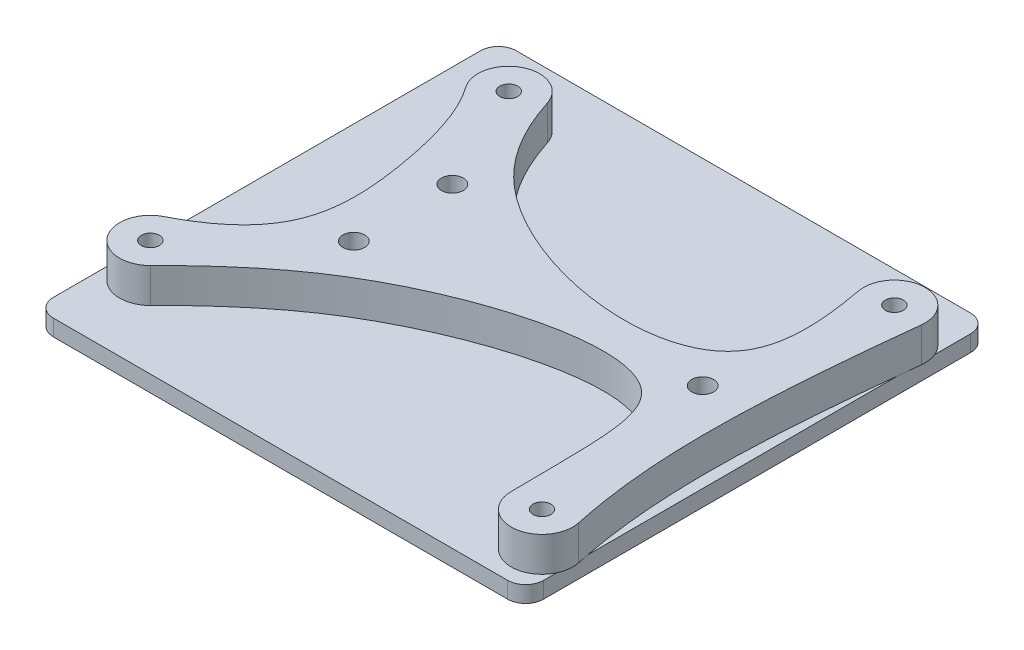
ISO-10303-21;
HEADER;
FILE_DESCRIPTION(('STEP AP214'),'2;1');
FILE_NAME('part.step','',(''),(''),'','','');
FILE_SCHEMA(('AUTOMOTIVE_DESIGN { 1 0 10303 214 1 1 1 1 }'));
ENDSEC;
DATA;
#1=APPLICATION_CONTEXT('core data for automotive mechanical design processes');
#2=APPLICATION_PROTOCOL_DEFINITION('international standard','automotive_design',2000,#1);
#3=PRODUCT_CONTEXT('',#1,'mechanical');
#4=PRODUCT('Part','Part','',(#3));
#5=PRODUCT_RELATED_PRODUCT_CATEGORY('part','',(#4));
#6=PRODUCT_DEFINITION_FORMATION('','',#4);
#7=PRODUCT_DEFINITION_CONTEXT('part definition',#1,'design');
#8=PRODUCT_DEFINITION('design','',#6,#7);
#9=PRODUCT_DEFINITION_SHAPE('','',#8);
#10=(LENGTH_UNIT() NAMED_UNIT(*) SI_UNIT(.MILLI.,.METRE.));
#11=(NAMED_UNIT(*) PLANE_ANGLE_UNIT() SI_UNIT($,.RADIAN.));
#12=(NAMED_UNIT(*) SI_UNIT($,.STERADIAN.) SOLID_ANGLE_UNIT());
#13=UNCERTAINTY_MEASURE_WITH_UNIT(LENGTH_MEASURE(1.E-05),#10,'distance_accuracy_value','');
#14=(GEOMETRIC_REPRESENTATION_CONTEXT(3) GLOBAL_UNCERTAINTY_ASSIGNED_CONTEXT((#13)) GLOBAL_UNIT_ASSIGNED_CONTEXT((#10,
#11,#12)) REPRESENTATION_CONTEXT('',''));
#15=CARTESIAN_POINT('',(0.,0.,0.));
#16=DIRECTION('',(0.,0.,1.));
#17=DIRECTION('',(1.,0.,0.));
#18=AXIS2_PLACEMENT_3D('',#15,#16,#17);
#19=CARTESIAN_POINT('',(61.3562786520063,9.35,-16.8953725225901));
#20=CARTESIAN_POINT('',(60.2027794429432,9.35,-6.60297791190577));
#21=CARTESIAN_POINT('',(58.2428992183162,9.35,14.0929435496525));
#22=CARTESIAN_POINT('',(58.9374862063049,9.35,34.7888430158028));
#23=CARTESIAN_POINT('',(61.3653600024996,9.35,46.0884653405845));
#24=B_SPLINE_CURVE_WITH_KNOTS('',3,(#19,#20,#21,#22,#23),.UNSPECIFIED.,.F.,.F.,(4,1,4),(0.,
0.477057230479133,1.),.UNSPECIFIED.);
#25=DIRECTION('',(0.,-1.,0.));
#26=VECTOR('',#25,1.);
#27=SURFACE_OF_LINEAR_EXTRUSION('',#24,#26);
#28=CARTESIAN_POINT('',(61.3562786520063,3.,-16.8953725225901));
#29=CARTESIAN_POINT('',(60.2027794429432,3.,-6.60297791190577));
#30=CARTESIAN_POINT('',(58.2428992183162,3.,14.0929435496525));
#31=CARTESIAN_POINT('',(58.9374862063049,3.,34.7888430158028));
#32=CARTESIAN_POINT('',(61.3653600024996,3.,46.0884653405845));
#33=B_SPLINE_CURVE_WITH_KNOTS('',3,(#28,#29,#30,#31,#32),.UNSPECIFIED.,.F.,.F.,(4,1,4),(0.,
0.477057230479133,1.),.UNSPECIFIED.);
#34=CARTESIAN_POINT('',(61.3562786520063,3.,-16.8953725225901));
#35=VERTEX_POINT('',#34);
#36=CARTESIAN_POINT('',(61.3653600024996,3.,46.0884653405845));
#37=VERTEX_POINT('',#36);
#38=EDGE_CURVE('E201',#35,#37,#33,.T.);
#39=ORIENTED_EDGE('',*,*,#38,.F.);
#40=DIRECTION('',(0.,-1.,0.));
#41=VECTOR('',#40,1.);
#42=CARTESIAN_POINT('',(61.3562786520063,9.35,-16.8953725225901));
#43=LINE('',#42,#41);
#44=CARTESIAN_POINT('',(61.3562786520063,9.35,-16.8953725225901));
#45=VERTEX_POINT('',#44);
#46=EDGE_CURVE('E12',#45,#35,#43,.T.);
#47=ORIENTED_EDGE('',*,*,#46,.F.);
#48=CARTESIAN_POINT('',(61.3653600024996,9.35,46.0884653405845));
#49=VERTEX_POINT('',#48);
#50=EDGE_CURVE('E255',#45,#49,#24,.T.);
#51=ORIENTED_EDGE('',*,*,#50,.T.);
#52=DIRECTION('',(0.,-1.,0.));
#53=VECTOR('',#52,1.);
#54=CARTESIAN_POINT('',(61.3653600024996,9.35,46.0884653405845));
#55=LINE('',#54,#53);
#56=EDGE_CURVE('E100',#49,#37,#55,.T.);
#57=ORIENTED_EDGE('',*,*,#56,.T.);
#58=EDGE_LOOP('',(#39,#47,#51,#57));
#59=FACE_BOUND('',#58,.T.);
#60=ADVANCED_FACE('F48',(#59),#27,.T.);
#61=CARTESIAN_POINT('',(55.7414308426073,9.35,-17.5246451799393));
#62=DIRECTION('',(0.,-1.,0.));
#63=DIRECTION('',(0.,0.,-1.));
#64=AXIS2_PLACEMENT_3D('',#61,#62,#63);
#65=CYLINDRICAL_SURFACE('',#64,5.65);
#66=CARTESIAN_POINT('',(55.7414308426073,3.,-17.5246451799393));
#67=DIRECTION('',(0.,1.,0.));
#68=DIRECTION('',(0.,0.,1.));
#69=AXIS2_PLACEMENT_3D('',#66,#67,#68);
#70=CIRCLE('',#69,5.65);
#71=CARTESIAN_POINT('',(50.1907107750681,3.,-16.470127881922));
#72=VERTEX_POINT('',#71);
#73=EDGE_CURVE('E196',#35,#72,#70,.T.);
#74=ORIENTED_EDGE('',*,*,#73,.T.);
#75=DIRECTION('',(0.,-1.,0.));
#76=VECTOR('',#75,1.);
#77=CARTESIAN_POINT('',(50.1907107750681,9.35,-16.470127881922));
#78=LINE('',#77,#76);
#79=CARTESIAN_POINT('',(50.1907107750681,9.35,-16.470127881922));
#80=VERTEX_POINT('',#79);
#81=EDGE_CURVE('E57',#80,#72,#78,.T.);
#82=ORIENTED_EDGE('',*,*,#81,.F.);
#83=CARTESIAN_POINT('',(55.7414308426073,9.35,-17.5246451799393));
#84=DIRECTION('',(0.,1.,0.));
#85=DIRECTION('',(0.,0.,1.));
#86=AXIS2_PLACEMENT_3D('',#83,#84,#85);
#87=CIRCLE('',#86,5.65);
#88=EDGE_CURVE('E180',#45,#80,#87,.T.);
#89=ORIENTED_EDGE('',*,*,#88,.F.);
#90=ORIENTED_EDGE('',*,*,#46,.T.);
#91=EDGE_LOOP('',(#74,#82,#89,#90));
#92=FACE_BOUND('',#91,.T.);
#93=ADVANCED_FACE('F186',(#92),#65,.T.);
#94=CARTESIAN_POINT('',(-8.28306734486056,9.35,-17.8643233868108));
#95=CARTESIAN_POINT('',(-6.34166016969181,9.35,-11.8654911040581));
#96=CARTESIAN_POINT('',(3.72454891437976,9.35,6.93469445895372));
#97=CARTESIAN_POINT('',(48.4310655080228,9.35,15.5322873185955));
#98=CARTESIAN_POINT('',(52.6448193584418,9.35,-3.55230302758804));
#99=CARTESIAN_POINT('',(50.1907107750681,9.35,-16.470127881922));
#100=B_SPLINE_CURVE_WITH_KNOTS('',3,(#94,#95,#96,#97,#98,#99),.UNSPECIFIED.,.F.,.F.,(4,1,1,4),
(0.,0.211562664026398,0.735099530781653,1.),.UNSPECIFIED.);
#101=DIRECTION('',(0.,-1.,0.));
#102=VECTOR('',#101,1.);
#103=SURFACE_OF_LINEAR_EXTRUSION('',#100,#102);
#104=CARTESIAN_POINT('',(-8.28306734486056,3.,-17.8643233868108));
#105=CARTESIAN_POINT('',(-6.34166016969181,3.,-11.8654911040581));
#106=CARTESIAN_POINT('',(3.72454891437976,3.,6.93469445895372));
#107=CARTESIAN_POINT('',(48.4310655080228,3.,15.5322873185955));
#108=CARTESIAN_POINT('',(52.6448193584418,3.,-3.55230302758804));
#109=CARTESIAN_POINT('',(50.1907107750681,3.,-16.470127881922));
#110=B_SPLINE_CURVE_WITH_KNOTS('',3,(#104,#105,#106,#107,#108,#109),.UNSPECIFIED.,.F.,.F.,(4,1,
1,4),(0.,0.211562664026398,0.735099530781653,1.),.UNSPECIFIED.);
#111=CARTESIAN_POINT('',(-8.28306734486056,3.,-17.8643233868108));
#112=VERTEX_POINT('',#111);
#113=EDGE_CURVE('E200',#112,#72,#110,.T.);
#114=ORIENTED_EDGE('',*,*,#113,.F.);
#115=DIRECTION('',(0.,-1.,0.));
#116=VECTOR('',#115,1.);
#117=CARTESIAN_POINT('',(-8.28306734486056,9.35,-17.8643233868108));
#118=LINE('',#117,#116);
#119=CARTESIAN_POINT('',(-8.28306734486056,9.35,-17.8643233868108));
#120=VERTEX_POINT('',#119);
#121=EDGE_CURVE('E263',#120,#112,#118,.T.);
#122=ORIENTED_EDGE('',*,*,#121,.F.);
#123=EDGE_CURVE('E174',#120,#80,#100,.T.);
#124=ORIENTED_EDGE('',*,*,#123,.T.);
#125=ORIENTED_EDGE('',*,*,#81,.T.);
#126=EDGE_LOOP('',(#114,#122,#124,#125));
#127=FACE_BOUND('',#126,.T.);
#128=ADVANCED_FACE('F184',(#127),#103,.T.);
#129=CARTESIAN_POINT('',(-13.6585691573927,9.35,-16.1246451799393));
#130=DIRECTION('',(0.,-1.,0.));
#131=DIRECTION('',(0.,0.,-1.));
#132=AXIS2_PLACEMENT_3D('',#129,#130,#131);
#133=CYLINDRICAL_SURFACE('',#132,5.65);
#134=CARTESIAN_POINT('',(-13.6585691573927,3.,-16.1246451799393));
#135=DIRECTION('',(0.,1.,0.));
#136=DIRECTION('',(0.,0.,1.));
#137=AXIS2_PLACEMENT_3D('',#134,#135,#136);
#138=CIRCLE('',#137,5.65);
#139=CARTESIAN_POINT('',(-18.2569112068383,3.,-12.8416967495949));
#140=VERTEX_POINT('',#139);
#141=EDGE_CURVE('E208',#112,#140,#138,.T.);
#142=ORIENTED_EDGE('',*,*,#141,.T.);
#143=DIRECTION('',(0.,-1.,0.));
#144=VECTOR('',#143,1.);
#145=CARTESIAN_POINT('',(-18.2569112068383,9.35,-12.8416967495949));
#146=LINE('',#145,#144);
#147=CARTESIAN_POINT('',(-18.2569112068383,9.35,-12.8416967495949));
#148=VERTEX_POINT('',#147);
#149=EDGE_CURVE('E260',#148,#140,#146,.T.);
#150=ORIENTED_EDGE('',*,*,#149,.F.);
#151=CARTESIAN_POINT('',(-13.6585691573927,9.35,-16.1246451799393));
#152=DIRECTION('',(0.,1.,0.));
#153=DIRECTION('',(0.,0.,1.));
#154=AXIS2_PLACEMENT_3D('',#151,#152,#153);
#155=CIRCLE('',#154,5.65);
#156=EDGE_CURVE('E169',#120,#148,#155,.T.);
#157=ORIENTED_EDGE('',*,*,#156,.F.);
#158=ORIENTED_EDGE('',*,*,#121,.T.);
#159=EDGE_LOOP('',(#142,#150,#157,#158));
#160=FACE_BOUND('',#159,.T.);
#161=ADVANCED_FACE('F162',(#160),#133,.T.);
#162=CARTESIAN_POINT('',(-18.2569112068383,9.35,-12.8416967495949));
#163=CARTESIAN_POINT('',(-14.929136489817,9.35,-8.18056766486064));
#164=CARTESIAN_POINT('',(-11.4742294970473,9.35,4.29949697767611));
#165=CARTESIAN_POINT('',(-9.93847644013207,9.35,23.7155780269013));
#166=CARTESIAN_POINT('',(-18.3040907655099,9.35,31.8350852793079));
#167=CARTESIAN_POINT('',(-25.4115159241871,9.35,35.4350212194035));
#168=B_SPLINE_CURVE_WITH_KNOTS('',3,(#162,#163,#164,#165,#166,#167),.UNSPECIFIED.,.F.,.F.,(4,1,
1,4),(0.,0.348075625897388,0.653605665315245,1.),.UNSPECIFIED.);
#169=DIRECTION('',(0.,-1.,0.));
#170=VECTOR('',#169,1.);
#171=SURFACE_OF_LINEAR_EXTRUSION('',#168,#170);
#172=CARTESIAN_POINT('',(-18.2569112068383,3.,-12.8416967495949));
#173=CARTESIAN_POINT('',(-14.929136489817,3.,-8.18056766486064));
#174=CARTESIAN_POINT('',(-11.4742294970473,3.,4.29949697767611));
#175=CARTESIAN_POINT('',(-9.93847644013207,3.,23.7155780269013));
#176=CARTESIAN_POINT('',(-18.3040907655099,3.,31.8350852793079));
#177=CARTESIAN_POINT('',(-25.4115159241871,3.,35.4350212194035));
#178=B_SPLINE_CURVE_WITH_KNOTS('',3,(#172,#173,#174,#175,#176,#177),.UNSPECIFIED.,.F.,.F.,(4,1,
1,4),(0.,0.348075625897388,0.653605665315245,1.),.UNSPECIFIED.);
#179=CARTESIAN_POINT('',(-25.4115159241871,3.,35.4350212194035));
#180=VERTEX_POINT('',#179);
#181=EDGE_CURVE('E210',#140,#180,#178,.T.);
#182=ORIENTED_EDGE('',*,*,#181,.T.);
#183=DIRECTION('',(0.,-1.,0.));
#184=VECTOR('',#183,1.);
#185=CARTESIAN_POINT('',(-25.4115159241871,9.35,35.4350212194035));
#186=LINE('',#185,#184);
#187=CARTESIAN_POINT('',(-25.4115159241871,9.35,35.4350212194035));
#188=VERTEX_POINT('',#187);
#189=EDGE_CURVE('E135',#188,#180,#186,.T.);
#190=ORIENTED_EDGE('',*,*,#189,.F.);
#191=EDGE_CURVE('E126',#148,#188,#168,.T.);
#192=ORIENTED_EDGE('',*,*,#191,.F.);
#193=ORIENTED_EDGE('',*,*,#149,.T.);
#194=EDGE_LOOP('',(#182,#190,#192,#193));
#195=FACE_BOUND('',#194,.T.);
#196=ADVANCED_FACE('F159',(#195),#171,.F.);
#197=CARTESIAN_POINT('',(-22.8585691573927,9.35,40.4753548200607));
#198=DIRECTION('',(0.,-1.,0.));
#199=DIRECTION('',(0.,0.,-1.));
#200=AXIS2_PLACEMENT_3D('',#197,#198,#199);
#201=CYLINDRICAL_SURFACE('',#200,5.65);
#202=CARTESIAN_POINT('',(-22.8585691573927,3.,40.4753548200607));
#203=DIRECTION('',(0.,1.,0.));
#204=DIRECTION('',(0.,0.,1.));
#205=AXIS2_PLACEMENT_3D('',#202,#203,#204);
#206=CIRCLE('',#205,5.65);
#207=CARTESIAN_POINT('',(-18.8531785347097,3.,44.4602445248987));
#208=VERTEX_POINT('',#207);
#209=EDGE_CURVE('E134',#180,#208,#206,.T.);
#210=ORIENTED_EDGE('',*,*,#209,.T.);
#211=DIRECTION('',(0.,-1.,0.));
#212=VECTOR('',#211,1.);
#213=CARTESIAN_POINT('',(-18.8531785347097,9.35,44.4602445248987));
#214=LINE('',#213,#212);
#215=CARTESIAN_POINT('',(-18.8531785347097,9.35,44.4602445248987));
#216=VERTEX_POINT('',#215);
#217=EDGE_CURVE('E131',#216,#208,#214,.T.);
#218=ORIENTED_EDGE('',*,*,#217,.F.);
#219=CARTESIAN_POINT('',(-22.8585691573927,9.35,40.4753548200607));
#220=DIRECTION('',(0.,1.,0.));
#221=DIRECTION('',(0.,0.,1.));
#222=AXIS2_PLACEMENT_3D('',#219,#220,#221);
#223=CIRCLE('',#222,5.65);
#224=EDGE_CURVE('E119',#188,#216,#223,.T.);
#225=ORIENTED_EDGE('',*,*,#224,.F.);
#226=ORIENTED_EDGE('',*,*,#189,.T.);
#227=EDGE_LOOP('',(#210,#218,#225,#226));
#228=FACE_BOUND('',#227,.T.);
#229=ADVANCED_FACE('F132',(#228),#201,.T.);
#230=CARTESIAN_POINT('',(-18.8531785347097,9.35,44.4602445248987));
#231=CARTESIAN_POINT('',(-14.4751774113926,9.35,40.0597200576491));
#232=CARTESIAN_POINT('',(4.00893819277812,9.35,22.2236347246501));
#233=CARTESIAN_POINT('',(51.7423012430756,9.35,8.84281422389033));
#234=CARTESIAN_POINT('',(49.964952892826,9.35,31.643532919664));
#235=CARTESIAN_POINT('',(50.192020660356,9.35,47.3569917766101));
#236=B_SPLINE_CURVE_WITH_KNOTS('',3,(#230,#231,#232,#233,#234,#235),.UNSPECIFIED.,.F.,.F.,(4,1,
1,4),(0.,0.247102158720302,0.71381752012966,1.),.UNSPECIFIED.);
#237=DIRECTION('',(0.,-1.,0.));
#238=VECTOR('',#237,1.);
#239=SURFACE_OF_LINEAR_EXTRUSION('',#236,#238);
#240=CARTESIAN_POINT('',(-18.8531785347097,3.,44.4602445248987));
#241=CARTESIAN_POINT('',(-14.4751774113926,3.,40.0597200576491));
#242=CARTESIAN_POINT('',(4.00893819277812,3.,22.2236347246501));
#243=CARTESIAN_POINT('',(51.7423012430756,3.,8.84281422389033));
#244=CARTESIAN_POINT('',(49.964952892826,3.,31.643532919664));
#245=CARTESIAN_POINT('',(50.192020660356,3.,47.3569917766101));
#246=B_SPLINE_CURVE_WITH_KNOTS('',3,(#240,#241,#242,#243,#244,#245),.UNSPECIFIED.,.F.,.F.,(4,1,
1,4),(0.,0.247102158720302,0.71381752012966,1.),.UNSPECIFIED.);
#247=CARTESIAN_POINT('',(50.192020660356,3.,47.3569917766101));
#248=VERTEX_POINT('',#247);
#249=EDGE_CURVE('E93',#208,#248,#246,.T.);
#250=ORIENTED_EDGE('',*,*,#249,.T.);
#251=DIRECTION('',(0.,-1.,0.));
#252=VECTOR('',#251,1.);
#253=CARTESIAN_POINT('',(50.192020660356,9.35,47.3569917766101));
#254=LINE('',#253,#252);
#255=CARTESIAN_POINT('',(50.192020660356,9.35,47.3569917766101));
#256=VERTEX_POINT('',#255);
#257=EDGE_CURVE('E136',#256,#248,#254,.T.);
#258=ORIENTED_EDGE('',*,*,#257,.F.);
#259=EDGE_CURVE('E124',#216,#256,#236,.T.);
#260=ORIENTED_EDGE('',*,*,#259,.F.);
#261=ORIENTED_EDGE('',*,*,#217,.T.);
#262=EDGE_LOOP('',(#250,#258,#260,#261));
#263=FACE_BOUND('',#262,.T.);
#264=ADVANCED_FACE('F138',(#263),#239,.F.);
#265=CARTESIAN_POINT('',(55.7414308426073,9.35,-17.5246451799393));
#266=DIRECTION('',(0.,-1.,0.));
#267=DIRECTION('',(0.,0.,-1.));
#268=AXIS2_PLACEMENT_3D('',#265,#266,#267);
#269=CYLINDRICAL_SURFACE('',#268,1.65);
#270=CARTESIAN_POINT('',(55.7414308426073,9.35,-17.5246451799393));
#271=DIRECTION('',(0.,1.,0.));
#272=DIRECTION('',(0.,0.,1.));
#273=AXIS2_PLACEMENT_3D('',#270,#271,#272);
#274=CIRCLE('',#273,1.65);
#275=CARTESIAN_POINT('',(55.7414308426073,9.35,-15.8746451799393));
#276=VERTEX_POINT('',#275);
#277=EDGE_CURVE('E282',#276,#276,#274,.T.);
#278=ORIENTED_EDGE('',*,*,#277,.T.);
#279=EDGE_LOOP('',(#278));
#280=FACE_BOUND('',#279,.T.);
#281=CARTESIAN_POINT('',(55.7414308426073,3.,-17.5246451799393));
#282=DIRECTION('',(0.,1.,0.));
#283=DIRECTION('',(0.,0.,1.));
#284=AXIS2_PLACEMENT_3D('',#281,#282,#283);
#285=CIRCLE('',#284,1.65);
#286=CARTESIAN_POINT('',(55.7414308426073,3.,-15.8746451799393));
#287=VERTEX_POINT('',#286);
#288=EDGE_CURVE('E249',#287,#287,#285,.T.);
#289=ORIENTED_EDGE('',*,*,#288,.F.);
#290=EDGE_LOOP('',(#289));
#291=FACE_BOUND('',#290,.T.);
#292=ADVANCED_FACE('F154',(#280,#291),#269,.F.);
#293=CARTESIAN_POINT('',(55.8414308426073,9.35,47.2753548200607));
#294=DIRECTION('',(0.,-1.,0.));
#295=DIRECTION('',(0.,0.,-1.));
#296=AXIS2_PLACEMENT_3D('',#293,#294,#295);
#297=CYLINDRICAL_SURFACE('',#296,1.65);
#298=CARTESIAN_POINT('',(55.8414308426073,9.35,47.2753548200607));
#299=DIRECTION('',(0.,1.,0.));
#300=DIRECTION('',(0.,0.,1.));
#301=AXIS2_PLACEMENT_3D('',#298,#299,#300);
#302=CIRCLE('',#301,1.65);
#303=CARTESIAN_POINT('',(55.8414308426073,9.35,48.9253548200607));
#304=VERTEX_POINT('',#303);
#305=EDGE_CURVE('E285',#304,#304,#302,.T.);
#306=ORIENTED_EDGE('',*,*,#305,.T.);
#307=EDGE_LOOP('',(#306));
#308=FACE_BOUND('',#307,.T.);
#309=CARTESIAN_POINT('',(55.8414308426073,3.,47.2753548200607));
#310=DIRECTION('',(0.,1.,0.));
#311=DIRECTION('',(0.,0.,1.));
#312=AXIS2_PLACEMENT_3D('',#309,#310,#311);
#313=CIRCLE('',#312,1.65);
#314=CARTESIAN_POINT('',(55.8414308426073,3.,48.9253548200607));
#315=VERTEX_POINT('',#314);
#316=EDGE_CURVE('E246',#315,#315,#313,.T.);
#317=ORIENTED_EDGE('',*,*,#316,.F.);
#318=EDGE_LOOP('',(#317));
#319=FACE_BOUND('',#318,.T.);
#320=ADVANCED_FACE('F329',(#308,#319),#297,.F.);
#321=CARTESIAN_POINT('',(-4.05856915739272,9.35,21.9253548200607));
#322=DIRECTION('',(0.,-1.,0.));
#323=DIRECTION('',(0.,0.,-1.));
#324=AXIS2_PLACEMENT_3D('',#321,#322,#323);
#325=CYLINDRICAL_SURFACE('',#324,2.);
#326=CARTESIAN_POINT('',(-4.05856915739272,9.35,21.9253548200607));
#327=DIRECTION('',(0.,1.,0.));
#328=DIRECTION('',(0.,0.,1.));
#329=AXIS2_PLACEMENT_3D('',#326,#327,#328);
#330=CIRCLE('',#329,2.);
#331=CARTESIAN_POINT('',(-4.05856915739272,9.35,23.9253548200607));
#332=VERTEX_POINT('',#331);
#333=EDGE_CURVE('E288',#332,#332,#330,.T.);
#334=ORIENTED_EDGE('',*,*,#333,.T.);
#335=EDGE_LOOP('',(#334));
#336=FACE_BOUND('',#335,.T.);
#337=CARTESIAN_POINT('',(-4.05856915739272,3.,21.9253548200607));
#338=DIRECTION('',(0.,1.,0.));
#339=DIRECTION('',(0.,0.,1.));
#340=AXIS2_PLACEMENT_3D('',#337,#338,#339);
#341=CIRCLE('',#340,2.);
#342=CARTESIAN_POINT('',(-4.05856915739272,3.,23.9253548200607));
#343=VERTEX_POINT('',#342);
#344=EDGE_CURVE('E243',#343,#343,#341,.T.);
#345=ORIENTED_EDGE('',*,*,#344,.F.);
#346=EDGE_LOOP('',(#345));
#347=FACE_BOUND('',#346,.T.);
#348=ADVANCED_FACE('F333',(#336,#347),#325,.F.);
#349=CARTESIAN_POINT('',(50.9414308426073,9.35,12.8753548200607));
#350=DIRECTION('',(0.,-1.,0.));
#351=DIRECTION('',(0.,0.,-1.));
#352=AXIS2_PLACEMENT_3D('',#349,#350,#351);
#353=CYLINDRICAL_SURFACE('',#352,2.);
#354=CARTESIAN_POINT('',(50.9414308426073,9.35,12.8753548200607));
#355=DIRECTION('',(0.,1.,0.));
#356=DIRECTION('',(0.,0.,1.));
#357=AXIS2_PLACEMENT_3D('',#354,#355,#356);
#358=CIRCLE('',#357,2.);
#359=CARTESIAN_POINT('',(50.9414308426073,9.35,14.8753548200607));
#360=VERTEX_POINT('',#359);
#361=EDGE_CURVE('E291',#360,#360,#358,.T.);
#362=ORIENTED_EDGE('',*,*,#361,.T.);
#363=EDGE_LOOP('',(#362));
#364=FACE_BOUND('',#363,.T.);
#365=CARTESIAN_POINT('',(50.9414308426073,3.,12.8753548200607));
#366=DIRECTION('',(0.,1.,0.));
#367=DIRECTION('',(0.,0.,1.));
#368=AXIS2_PLACEMENT_3D('',#365,#366,#367);
#369=CIRCLE('',#368,2.);
#370=CARTESIAN_POINT('',(50.9414308426073,3.,14.8753548200607));
#371=VERTEX_POINT('',#370);
#372=EDGE_CURVE('E240',#371,#371,#369,.T.);
#373=ORIENTED_EDGE('',*,*,#372,.F.);
#374=EDGE_LOOP('',(#373));
#375=FACE_BOUND('',#374,.T.);
#376=ADVANCED_FACE('F337',(#364,#375),#353,.F.);
#377=CARTESIAN_POINT('',(-13.6585691573927,9.35,-16.1246451799393));
#378=DIRECTION('',(0.,-1.,0.));
#379=DIRECTION('',(0.,0.,-1.));
#380=AXIS2_PLACEMENT_3D('',#377,#378,#379);
#381=CYLINDRICAL_SURFACE('',#380,1.65);
#382=CARTESIAN_POINT('',(-13.6585691573927,9.35,-16.1246451799393));
#383=DIRECTION('',(0.,1.,0.));
#384=DIRECTION('',(0.,0.,1.));
#385=AXIS2_PLACEMENT_3D('',#382,#383,#384);
#386=CIRCLE('',#385,1.65);
#387=CARTESIAN_POINT('',(-13.6585691573927,9.35,-14.4746451799393));
#388=VERTEX_POINT('',#387);
#389=EDGE_CURVE('E294',#388,#388,#386,.T.);
#390=ORIENTED_EDGE('',*,*,#389,.T.);
#391=EDGE_LOOP('',(#390));
#392=FACE_BOUND('',#391,.T.);
#393=CARTESIAN_POINT('',(-13.6585691573927,3.,-16.1246451799393));
#394=DIRECTION('',(0.,1.,0.));
#395=DIRECTION('',(0.,0.,1.));
#396=AXIS2_PLACEMENT_3D('',#393,#394,#395);
#397=CIRCLE('',#396,1.65);
#398=CARTESIAN_POINT('',(-13.6585691573927,3.,-14.4746451799393));
#399=VERTEX_POINT('',#398);
#400=EDGE_CURVE('E237',#399,#399,#397,.T.);
#401=ORIENTED_EDGE('',*,*,#400,.F.);
#402=EDGE_LOOP('',(#401));
#403=FACE_BOUND('',#402,.T.);
#404=ADVANCED_FACE('F341',(#392,#403),#381,.F.);
#405=CARTESIAN_POINT('',(-4.05856915739271,9.35,3.82535482006073));
#406=DIRECTION('',(0.,-1.,0.));
#407=DIRECTION('',(0.,0.,-1.));
#408=AXIS2_PLACEMENT_3D('',#405,#406,#407);
#409=CYLINDRICAL_SURFACE('',#408,2.);
#410=CARTESIAN_POINT('',(-4.05856915739271,9.35,3.82535482006073));
#411=DIRECTION('',(0.,1.,0.));
#412=DIRECTION('',(0.,0.,1.));
#413=AXIS2_PLACEMENT_3D('',#410,#411,#412);
#414=CIRCLE('',#413,2.);
#415=CARTESIAN_POINT('',(-4.05856915739271,9.35,5.82535482006073));
#416=VERTEX_POINT('',#415);
#417=EDGE_CURVE('E140',#416,#416,#414,.T.);
#418=ORIENTED_EDGE('',*,*,#417,.T.);
#419=EDGE_LOOP('',(#418));
#420=FACE_BOUND('',#419,.T.);
#421=CARTESIAN_POINT('',(-4.05856915739271,3.,3.82535482006073));
#422=DIRECTION('',(0.,1.,0.));
#423=DIRECTION('',(0.,0.,1.));
#424=AXIS2_PLACEMENT_3D('',#421,#422,#423);
#425=CIRCLE('',#424,2.);
#426=CARTESIAN_POINT('',(-4.05856915739271,3.,5.82535482006073));
#427=VERTEX_POINT('',#426);
#428=EDGE_CURVE('E234',#427,#427,#425,.T.);
#429=ORIENTED_EDGE('',*,*,#428,.F.);
#430=EDGE_LOOP('',(#429));
#431=FACE_BOUND('',#430,.T.);
#432=ADVANCED_FACE('F299',(#420,#431),#409,.F.);
#433=CARTESIAN_POINT('',(55.8414308426073,9.35,47.2753548200607));
#434=DIRECTION('',(0.,-1.,0.));
#435=DIRECTION('',(0.,0.,-1.));
#436=AXIS2_PLACEMENT_3D('',#433,#434,#435);
#437=CYLINDRICAL_SURFACE('',#436,5.65);
#438=CARTESIAN_POINT('',(55.8414308426073,3.,47.2753548200607));
#439=DIRECTION('',(0.,1.,0.));
#440=DIRECTION('',(0.,0.,1.));
#441=AXIS2_PLACEMENT_3D('',#438,#439,#440);
#442=CIRCLE('',#441,5.65);
#443=EDGE_CURVE('E229',#248,#37,#442,.T.);
#444=ORIENTED_EDGE('',*,*,#443,.T.);
#445=ORIENTED_EDGE('',*,*,#56,.F.);
#446=CARTESIAN_POINT('',(55.8414308426073,9.35,47.2753548200607));
#447=DIRECTION('',(0.,1.,0.));
#448=DIRECTION('',(0.,0.,1.));
#449=AXIS2_PLACEMENT_3D('',#446,#447,#448);
#450=CIRCLE('',#449,5.65);
#451=EDGE_CURVE('E65',#256,#49,#450,.T.);
#452=ORIENTED_EDGE('',*,*,#451,.F.);
#453=ORIENTED_EDGE('',*,*,#257,.T.);
#454=EDGE_LOOP('',(#444,#445,#452,#453));
#455=FACE_BOUND('',#454,.T.);
#456=ADVANCED_FACE('F155',(#455),#437,.T.);
#457=CARTESIAN_POINT('',(-22.8585691573927,9.35,40.4753548200607));
#458=DIRECTION('',(0.,-1.,0.));
#459=DIRECTION('',(0.,0.,-1.));
#460=AXIS2_PLACEMENT_3D('',#457,#458,#459);
#461=CYLINDRICAL_SURFACE('',#460,1.65);
#462=CARTESIAN_POINT('',(-22.8585691573927,9.35,40.4753548200607));
#463=DIRECTION('',(0.,1.,0.));
#464=DIRECTION('',(0.,0.,1.));
#465=AXIS2_PLACEMENT_3D('',#462,#463,#464);
#466=CIRCLE('',#465,1.65);
#467=CARTESIAN_POINT('',(-22.8585691573927,9.35,42.1253548200607));
#468=VERTEX_POINT('',#467);
#469=EDGE_CURVE('E257',#468,#468,#466,.T.);
#470=ORIENTED_EDGE('',*,*,#469,.T.);
#471=EDGE_LOOP('',(#470));
#472=FACE_BOUND('',#471,.T.);
#473=CARTESIAN_POINT('',(-22.8585691573927,3.,40.4753548200607));
#474=DIRECTION('',(0.,1.,0.));
#475=DIRECTION('',(0.,0.,1.));
#476=AXIS2_PLACEMENT_3D('',#473,#474,#475);
#477=CIRCLE('',#476,1.65);
#478=CARTESIAN_POINT('',(-22.8585691573927,3.,42.1253548200607));
#479=VERTEX_POINT('',#478);
#480=EDGE_CURVE('E252',#479,#479,#477,.T.);
#481=ORIENTED_EDGE('',*,*,#480,.F.);
#482=EDGE_LOOP('',(#481));
#483=FACE_BOUND('',#482,.T.);
#484=ADVANCED_FACE('F303',(#472,#483),#461,.F.);
#485=CARTESIAN_POINT('',(0.,9.35,0.));
#486=DIRECTION('',(0.,1.,0.));
#487=DIRECTION('',(0.,0.,1.));
#488=AXIS2_PLACEMENT_3D('',#485,#486,#487);
#489=PLANE('',#488);
#490=ORIENTED_EDGE('',*,*,#50,.F.);
#491=ORIENTED_EDGE('',*,*,#88,.T.);
#492=ORIENTED_EDGE('',*,*,#123,.F.);
#493=ORIENTED_EDGE('',*,*,#156,.T.);
#494=ORIENTED_EDGE('',*,*,#191,.T.);
#495=ORIENTED_EDGE('',*,*,#224,.T.);
#496=ORIENTED_EDGE('',*,*,#259,.T.);
#497=ORIENTED_EDGE('',*,*,#451,.T.);
#498=EDGE_LOOP('',(#490,#491,#492,#493,#494,#495,#496,#497));
#499=FACE_BOUND('',#498,.T.);
#500=ORIENTED_EDGE('',*,*,#417,.F.);
#501=EDGE_LOOP('',(#500));
#502=FACE_BOUND('',#501,.T.);
#503=ORIENTED_EDGE('',*,*,#389,.F.);
#504=EDGE_LOOP('',(#503));
#505=FACE_BOUND('',#504,.T.);
#506=ORIENTED_EDGE('',*,*,#361,.F.);
#507=EDGE_LOOP('',(#506));
#508=FACE_BOUND('',#507,.T.);
#509=ORIENTED_EDGE('',*,*,#333,.F.);
#510=EDGE_LOOP('',(#509));
#511=FACE_BOUND('',#510,.T.);
#512=ORIENTED_EDGE('',*,*,#305,.F.);
#513=EDGE_LOOP('',(#512));
#514=FACE_BOUND('',#513,.T.);
#515=ORIENTED_EDGE('',*,*,#277,.F.);
#516=EDGE_LOOP('',(#515));
#517=FACE_BOUND('',#516,.T.);
#518=ORIENTED_EDGE('',*,*,#469,.F.);
#519=EDGE_LOOP('',(#518));
#520=FACE_BOUND('',#519,.T.);
#521=ADVANCED_FACE('F121',(#499,#502,#505,#508,#511,#514,#517,#520),#489,.T.);
#522=CARTESIAN_POINT('',(0.,3.,0.));
#523=DIRECTION('',(0.,1.,0.));
#524=DIRECTION('',(0.,0.,1.));
#525=AXIS2_PLACEMENT_3D('',#522,#523,#524);
#526=PLANE('',#525);
#527=ORIENTED_EDGE('',*,*,#38,.T.);
#528=ORIENTED_EDGE('',*,*,#443,.F.);
#529=ORIENTED_EDGE('',*,*,#249,.F.);
#530=ORIENTED_EDGE('',*,*,#209,.F.);
#531=ORIENTED_EDGE('',*,*,#181,.F.);
#532=ORIENTED_EDGE('',*,*,#141,.F.);
#533=ORIENTED_EDGE('',*,*,#113,.T.);
#534=ORIENTED_EDGE('',*,*,#73,.F.);
#535=EDGE_LOOP('',(#527,#528,#529,#530,#531,#532,#533,#534));
#536=FACE_BOUND('',#535,.T.);
#537=ORIENTED_EDGE('',*,*,#428,.T.);
#538=EDGE_LOOP('',(#537));
#539=FACE_BOUND('',#538,.T.);
#540=ORIENTED_EDGE('',*,*,#400,.T.);
#541=EDGE_LOOP('',(#540));
#542=FACE_BOUND('',#541,.T.);
#543=ORIENTED_EDGE('',*,*,#372,.T.);
#544=EDGE_LOOP('',(#543));
#545=FACE_BOUND('',#544,.T.);
#546=ORIENTED_EDGE('',*,*,#344,.T.);
#547=EDGE_LOOP('',(#546));
#548=FACE_BOUND('',#547,.T.);
#549=ORIENTED_EDGE('',*,*,#316,.T.);
#550=EDGE_LOOP('',(#549));
#551=FACE_BOUND('',#550,.T.);
#552=ORIENTED_EDGE('',*,*,#288,.T.);
#553=EDGE_LOOP('',(#552));
#554=FACE_BOUND('',#553,.T.);
#555=ORIENTED_EDGE('',*,*,#480,.T.);
#556=EDGE_LOOP('',(#555));
#557=FACE_BOUND('',#556,.T.);
#558=ADVANCED_FACE('F205',(#536,#539,#542,#545,#548,#551,#554,#557),#526,.F.);
#559=CLOSED_SHELL('',(#60,#93,#128,#161,#196,#229,#264,#292,#320,#348,#376,#404,#432,#456,#484,
#521,#558));
#560=MANIFOLD_SOLID_BREP('B2_NOT_SHOWN',#559);
#561=CARTESIAN_POINT('',(-29.0585691573927,3.,55.3753548200607));
#562=DIRECTION('',(1.,0.,0.));
#563=DIRECTION('',(0.,0.,-1.));
#564=AXIS2_PLACEMENT_3D('',#561,#562,#563);
#565=PLANE('',#564);
#566=DIRECTION('',(0.,0.,1.));
#567=VECTOR('',#566,1.);
#568=CARTESIAN_POINT('',(-29.0585691573927,0.,55.3753548200607));
#569=LINE('',#568,#567);
#570=CARTESIAN_POINT('',(-29.0585691573927,0.,-26.3246451799393));
#571=VERTEX_POINT('',#570);
#572=CARTESIAN_POINT('',(-29.0585691573927,0.,52.0753548200607));
#573=VERTEX_POINT('',#572);
#574=EDGE_CURVE('E649',#571,#573,#569,.T.);
#575=ORIENTED_EDGE('',*,*,#574,.T.);
#576=DIRECTION('',(0.,-1.,0.));
#577=VECTOR('',#576,1.);
#578=CARTESIAN_POINT('',(-29.0585691573927,3.,52.0753548200607));
#579=LINE('',#578,#577);
#580=CARTESIAN_POINT('',(-29.0585691573927,3.,52.0753548200607));
#581=VERTEX_POINT('',#580);
#582=EDGE_CURVE('E627',#573,#581,#579,.F.);
#583=ORIENTED_EDGE('',*,*,#582,.T.);
#584=DIRECTION('',(0.,0.,1.));
#585=VECTOR('',#584,1.);
#586=CARTESIAN_POINT('',(-29.0585691573927,3.,55.3753548200607));
#587=LINE('',#586,#585);
#588=CARTESIAN_POINT('',(-29.0585691573927,3.,-26.3246451799393));
#589=VERTEX_POINT('',#588);
#590=EDGE_CURVE('E659',#589,#581,#587,.T.);
#591=ORIENTED_EDGE('',*,*,#590,.F.);
#592=DIRECTION('',(0.,-1.,0.));
#593=VECTOR('',#592,1.);
#594=CARTESIAN_POINT('',(-29.0585691573927,3.,-26.3246451799393));
#595=LINE('',#594,#593);
#596=EDGE_CURVE('E632',#589,#571,#595,.T.);
#597=ORIENTED_EDGE('',*,*,#596,.T.);
#598=EDGE_LOOP('',(#575,#583,#591,#597));
#599=FACE_BOUND('',#598,.T.);
#600=ADVANCED_FACE('F556',(#599),#565,.F.);
#601=CARTESIAN_POINT('',(-29.0585691573927,3.,55.3753548200607));
#602=DIRECTION('',(0.,0.,-1.));
#603=DIRECTION('',(-1.,0.,0.));
#604=AXIS2_PLACEMENT_3D('',#601,#602,#603);
#605=PLANE('',#604);
#606=DIRECTION('',(1.,0.,0.));
#607=VECTOR('',#606,1.);
#608=CARTESIAN_POINT('',(-29.0585691573927,3.,55.3753548200607));
#609=LINE('',#608,#607);
#610=CARTESIAN_POINT('',(-25.7585691573927,3.,55.3753548200607));
#611=VERTEX_POINT('',#610);
#612=CARTESIAN_POINT('',(57.6414308426073,3.,55.3753548200607));
#613=VERTEX_POINT('',#612);
#614=EDGE_CURVE('E642',#611,#613,#609,.T.);
#615=ORIENTED_EDGE('',*,*,#614,.F.);
#616=DIRECTION('',(0.,-1.,0.));
#617=VECTOR('',#616,1.);
#618=CARTESIAN_POINT('',(-25.7585691573927,3.,55.3753548200607));
#619=LINE('',#618,#617);
#620=CARTESIAN_POINT('',(-25.7585691573927,0.,55.3753548200607));
#621=VERTEX_POINT('',#620);
#622=EDGE_CURVE('E626',#611,#621,#619,.T.);
#623=ORIENTED_EDGE('',*,*,#622,.T.);
#624=DIRECTION('',(1.,0.,0.));
#625=VECTOR('',#624,1.);
#626=CARTESIAN_POINT('',(-29.0585691573927,0.,55.3753548200607));
#627=LINE('',#626,#625);
#628=CARTESIAN_POINT('',(57.6414308426073,0.,55.3753548200607));
#629=VERTEX_POINT('',#628);
#630=EDGE_CURVE('E639',#621,#629,#627,.T.);
#631=ORIENTED_EDGE('',*,*,#630,.T.);
#632=DIRECTION('',(0.,-1.,0.));
#633=VECTOR('',#632,1.);
#634=CARTESIAN_POINT('',(57.6414308426073,3.,55.3753548200607));
#635=LINE('',#634,#633);
#636=EDGE_CURVE('E644',#629,#613,#635,.F.);
#637=ORIENTED_EDGE('',*,*,#636,.T.);
#638=EDGE_LOOP('',(#615,#623,#631,#637));
#639=FACE_BOUND('',#638,.T.);
#640=ADVANCED_FACE('F638',(#639),#605,.F.);
#641=CARTESIAN_POINT('',(60.9414308426073,3.,55.3753548200607));
#642=DIRECTION('',(-1.,0.,0.));
#643=DIRECTION('',(0.,0.,1.));
#644=AXIS2_PLACEMENT_3D('',#641,#642,#643);
#645=PLANE('',#644);
#646=DIRECTION('',(0.,0.,-1.));
#647=VECTOR('',#646,1.);
#648=CARTESIAN_POINT('',(60.9414308426073,3.,55.3753548200607));
#649=LINE('',#648,#647);
#650=CARTESIAN_POINT('',(60.9414308426073,3.,52.0753548200607));
#651=VERTEX_POINT('',#650);
#652=CARTESIAN_POINT('',(60.9414308426073,3.,-26.3246451799393));
#653=VERTEX_POINT('',#652);
#654=EDGE_CURVE('E685',#651,#653,#649,.T.);
#655=ORIENTED_EDGE('',*,*,#654,.F.);
#656=DIRECTION('',(0.,-1.,0.));
#657=VECTOR('',#656,1.);
#658=CARTESIAN_POINT('',(60.9414308426073,3.,52.0753548200607));
#659=LINE('',#658,#657);
#660=CARTESIAN_POINT('',(60.9414308426073,0.,52.0753548200607));
#661=VERTEX_POINT('',#660);
#662=EDGE_CURVE('E678',#651,#661,#659,.T.);
#663=ORIENTED_EDGE('',*,*,#662,.T.);
#664=DIRECTION('',(0.,0.,-1.));
#665=VECTOR('',#664,1.);
#666=CARTESIAN_POINT('',(60.9414308426073,0.,55.3753548200607));
#667=LINE('',#666,#665);
#668=CARTESIAN_POINT('',(60.9414308426073,0.,-26.3246451799393));
#669=VERTEX_POINT('',#668);
#670=EDGE_CURVE('E648',#661,#669,#667,.T.);
#671=ORIENTED_EDGE('',*,*,#670,.T.);
#672=DIRECTION('',(0.,-1.,0.));
#673=VECTOR('',#672,1.);
#674=CARTESIAN_POINT('',(60.9414308426073,3.,-26.3246451799393));
#675=LINE('',#674,#673);
#676=EDGE_CURVE('E676',#669,#653,#675,.F.);
#677=ORIENTED_EDGE('',*,*,#676,.T.);
#678=EDGE_LOOP('',(#655,#663,#671,#677));
#679=FACE_BOUND('',#678,.T.);
#680=ADVANCED_FACE('F683',(#679),#645,.F.);
#681=CARTESIAN_POINT('',(-29.0585691573927,3.,-29.6246451799393));
#682=DIRECTION('',(0.,0.,1.));
#683=DIRECTION('',(1.,0.,0.));
#684=AXIS2_PLACEMENT_3D('',#681,#682,#683);
#685=PLANE('',#684);
#686=DIRECTION('',(-1.,0.,0.));
#687=VECTOR('',#686,1.);
#688=CARTESIAN_POINT('',(-29.0585691573927,3.,-29.6246451799393));
#689=LINE('',#688,#687);
#690=CARTESIAN_POINT('',(57.6414308426073,3.,-29.6246451799393));
#691=VERTEX_POINT('',#690);
#692=CARTESIAN_POINT('',(-25.7585691573927,3.,-29.6246451799393));
#693=VERTEX_POINT('',#692);
#694=EDGE_CURVE('E660',#691,#693,#689,.T.);
#695=ORIENTED_EDGE('',*,*,#694,.F.);
#696=DIRECTION('',(0.,-1.,0.));
#697=VECTOR('',#696,1.);
#698=CARTESIAN_POINT('',(57.6414308426073,3.,-29.6246451799393));
#699=LINE('',#698,#697);
#700=CARTESIAN_POINT('',(57.6414308426073,0.,-29.6246451799393));
#701=VERTEX_POINT('',#700);
#702=EDGE_CURVE('E46',#691,#701,#699,.T.);
#703=ORIENTED_EDGE('',*,*,#702,.T.);
#704=DIRECTION('',(-1.,0.,0.));
#705=VECTOR('',#704,1.);
#706=CARTESIAN_POINT('',(-29.0585691573927,0.,-29.6246451799393));
#707=LINE('',#706,#705);
#708=CARTESIAN_POINT('',(-25.7585691573927,0.,-29.6246451799393));
#709=VERTEX_POINT('',#708);
#710=EDGE_CURVE('E652',#701,#709,#707,.T.);
#711=ORIENTED_EDGE('',*,*,#710,.T.);
#712=DIRECTION('',(0.,-1.,0.));
#713=VECTOR('',#712,1.);
#714=CARTESIAN_POINT('',(-25.7585691573927,3.,-29.6246451799393));
#715=LINE('',#714,#713);
#716=EDGE_CURVE('E564',#709,#693,#715,.F.);
#717=ORIENTED_EDGE('',*,*,#716,.T.);
#718=EDGE_LOOP('',(#695,#703,#711,#717));
#719=FACE_BOUND('',#718,.T.);
#720=ADVANCED_FACE('F692',(#719),#685,.F.);
#721=CARTESIAN_POINT('',(0.,3.,0.));
#722=DIRECTION('',(0.,-1.,0.));
#723=DIRECTION('',(0.,0.,-1.));
#724=AXIS2_PLACEMENT_3D('',#721,#722,#723);
#725=PLANE('',#724);
#726=CARTESIAN_POINT('',(-22.8585691573927,3.,40.4753548200607));
#727=DIRECTION('',(0.,1.,0.));
#728=DIRECTION('',(0.,0.,1.));
#729=AXIS2_PLACEMENT_3D('',#726,#727,#728);
#730=CIRCLE('',#729,1.65);
#731=CARTESIAN_POINT('',(-22.8585691573927,3.,42.1253548200607));
#732=VERTEX_POINT('',#731);
#733=EDGE_CURVE('E717',#732,#732,#730,.T.);
#734=ORIENTED_EDGE('',*,*,#733,.F.);
#735=EDGE_LOOP('',(#734));
#736=FACE_BOUND('',#735,.T.);
#737=CARTESIAN_POINT('',(55.8414308426073,3.,47.2753548200607));
#738=DIRECTION('',(0.,1.,0.));
#739=DIRECTION('',(0.,0.,1.));
#740=AXIS2_PLACEMENT_3D('',#737,#738,#739);
#741=CIRCLE('',#740,1.65);
#742=CARTESIAN_POINT('',(55.8414308426073,3.,48.9253548200607));
#743=VERTEX_POINT('',#742);
#744=EDGE_CURVE('E711',#743,#743,#741,.T.);
#745=ORIENTED_EDGE('',*,*,#744,.F.);
#746=EDGE_LOOP('',(#745));
#747=FACE_BOUND('',#746,.T.);
#748=CARTESIAN_POINT('',(55.7414308426073,3.,-17.5246451799393));
#749=DIRECTION('',(0.,1.,0.));
#750=DIRECTION('',(0.,0.,1.));
#751=AXIS2_PLACEMENT_3D('',#748,#749,#750);
#752=CIRCLE('',#751,1.65);
#753=CARTESIAN_POINT('',(55.7414308426073,3.,-15.8746451799393));
#754=VERTEX_POINT('',#753);
#755=EDGE_CURVE('E705',#754,#754,#752,.T.);
#756=ORIENTED_EDGE('',*,*,#755,.F.);
#757=EDGE_LOOP('',(#756));
#758=FACE_BOUND('',#757,.T.);
#759=CARTESIAN_POINT('',(-13.6585691573927,3.,-16.1246451799393));
#760=DIRECTION('',(0.,1.,0.));
#761=DIRECTION('',(0.,0.,1.));
#762=AXIS2_PLACEMENT_3D('',#759,#760,#761);
#763=CIRCLE('',#762,1.65);
#764=CARTESIAN_POINT('',(-13.6585691573927,3.,-14.4746451799393));
#765=VERTEX_POINT('',#764);
#766=EDGE_CURVE('E699',#765,#765,#763,.T.);
#767=ORIENTED_EDGE('',*,*,#766,.F.);
#768=EDGE_LOOP('',(#767));
#769=FACE_BOUND('',#768,.T.);
#770=ORIENTED_EDGE('',*,*,#590,.T.);
#771=CARTESIAN_POINT('',(-25.7585691573927,3.,52.0753548200607));
#772=DIRECTION('',(0.,-1.,0.));
#773=DIRECTION('',(0.,0.,-1.));
#774=AXIS2_PLACEMENT_3D('',#771,#772,#773);
#775=CIRCLE('',#774,3.3);
#776=EDGE_CURVE('E674',#581,#611,#775,.F.);
#777=ORIENTED_EDGE('',*,*,#776,.T.);
#778=ORIENTED_EDGE('',*,*,#614,.T.);
#779=CARTESIAN_POINT('',(57.6414308426073,3.,52.0753548200607));
#780=DIRECTION('',(0.,-1.,0.));
#781=DIRECTION('',(0.,0.,-1.));
#782=AXIS2_PLACEMENT_3D('',#779,#780,#781);
#783=CIRCLE('',#782,3.3);
#784=EDGE_CURVE('E672',#613,#651,#783,.F.);
#785=ORIENTED_EDGE('',*,*,#784,.T.);
#786=ORIENTED_EDGE('',*,*,#654,.T.);
#787=CARTESIAN_POINT('',(57.6414308426073,3.,-26.3246451799393));
#788=DIRECTION('',(0.,-1.,0.));
#789=DIRECTION('',(0.,0.,-1.));
#790=AXIS2_PLACEMENT_3D('',#787,#788,#789);
#791=CIRCLE('',#790,3.3);
#792=EDGE_CURVE('E577',#653,#691,#791,.F.);
#793=ORIENTED_EDGE('',*,*,#792,.T.);
#794=ORIENTED_EDGE('',*,*,#694,.T.);
#795=CARTESIAN_POINT('',(-25.7585691573927,3.,-26.3246451799393));
#796=DIRECTION('',(0.,-1.,0.));
#797=DIRECTION('',(0.,0.,-1.));
#798=AXIS2_PLACEMENT_3D('',#795,#796,#797);
#799=CIRCLE('',#798,3.3);
#800=EDGE_CURVE('E669',#693,#589,#799,.F.);
#801=ORIENTED_EDGE('',*,*,#800,.T.);
#802=EDGE_LOOP('',(#770,#777,#778,#785,#786,#793,#794,#801));
#803=FACE_BOUND('',#802,.T.);
#804=ADVANCED_FACE('F732',(#736,#747,#758,#769,#803),#725,.F.);
#805=CARTESIAN_POINT('',(0.,0.,0.));
#806=DIRECTION('',(0.,-1.,0.));
#807=DIRECTION('',(0.,0.,-1.));
#808=AXIS2_PLACEMENT_3D('',#805,#806,#807);
#809=PLANE('',#808);
#810=CARTESIAN_POINT('',(-22.8585691573927,0.,40.4753548200607));
#811=DIRECTION('',(0.,1.,0.));
#812=DIRECTION('',(0.,0.,1.));
#813=AXIS2_PLACEMENT_3D('',#810,#811,#812);
#814=CIRCLE('',#813,1.65);
#815=CARTESIAN_POINT('',(-22.8585691573927,0.,42.1253548200607));
#816=VERTEX_POINT('',#815);
#817=EDGE_CURVE('E714',#816,#816,#814,.T.);
#818=ORIENTED_EDGE('',*,*,#817,.T.);
#819=EDGE_LOOP('',(#818));
#820=FACE_BOUND('',#819,.T.);
#821=CARTESIAN_POINT('',(55.8414308426073,0.,47.2753548200607));
#822=DIRECTION('',(0.,1.,0.));
#823=DIRECTION('',(0.,0.,1.));
#824=AXIS2_PLACEMENT_3D('',#821,#822,#823);
#825=CIRCLE('',#824,1.65);
#826=CARTESIAN_POINT('',(55.8414308426073,0.,48.9253548200607));
#827=VERTEX_POINT('',#826);
#828=EDGE_CURVE('E708',#827,#827,#825,.T.);
#829=ORIENTED_EDGE('',*,*,#828,.T.);
#830=EDGE_LOOP('',(#829));
#831=FACE_BOUND('',#830,.T.);
#832=CARTESIAN_POINT('',(55.7414308426073,0.,-17.5246451799393));
#833=DIRECTION('',(0.,1.,0.));
#834=DIRECTION('',(0.,0.,1.));
#835=AXIS2_PLACEMENT_3D('',#832,#833,#834);
#836=CIRCLE('',#835,1.65);
#837=CARTESIAN_POINT('',(55.7414308426073,0.,-15.8746451799393));
#838=VERTEX_POINT('',#837);
#839=EDGE_CURVE('E702',#838,#838,#836,.T.);
#840=ORIENTED_EDGE('',*,*,#839,.T.);
#841=EDGE_LOOP('',(#840));
#842=FACE_BOUND('',#841,.T.);
#843=CARTESIAN_POINT('',(-13.6585691573927,0.,-16.1246451799393));
#844=DIRECTION('',(0.,1.,0.));
#845=DIRECTION('',(0.,0.,1.));
#846=AXIS2_PLACEMENT_3D('',#843,#844,#845);
#847=CIRCLE('',#846,1.65);
#848=CARTESIAN_POINT('',(-13.6585691573927,0.,-14.4746451799393));
#849=VERTEX_POINT('',#848);
#850=EDGE_CURVE('E654',#849,#849,#847,.T.);
#851=ORIENTED_EDGE('',*,*,#850,.T.);
#852=EDGE_LOOP('',(#851));
#853=FACE_BOUND('',#852,.T.);
#854=ORIENTED_EDGE('',*,*,#630,.F.);
#855=CARTESIAN_POINT('',(-25.7585691573927,0.,52.0753548200607));
#856=DIRECTION('',(0.,-1.,0.));
#857=DIRECTION('',(0.,0.,-1.));
#858=AXIS2_PLACEMENT_3D('',#855,#856,#857);
#859=CIRCLE('',#858,3.3);
#860=EDGE_CURVE('E622',#621,#573,#859,.T.);
#861=ORIENTED_EDGE('',*,*,#860,.T.);
#862=ORIENTED_EDGE('',*,*,#574,.F.);
#863=CARTESIAN_POINT('',(-25.7585691573927,0.,-26.3246451799393));
#864=DIRECTION('',(0.,-1.,0.));
#865=DIRECTION('',(0.,0.,-1.));
#866=AXIS2_PLACEMENT_3D('',#863,#864,#865);
#867=CIRCLE('',#866,3.3);
#868=EDGE_CURVE('E643',#571,#709,#867,.T.);
#869=ORIENTED_EDGE('',*,*,#868,.T.);
#870=ORIENTED_EDGE('',*,*,#710,.F.);
#871=CARTESIAN_POINT('',(57.6414308426073,0.,-26.3246451799393));
#872=DIRECTION('',(0.,-1.,0.));
#873=DIRECTION('',(0.,0.,-1.));
#874=AXIS2_PLACEMENT_3D('',#871,#872,#873);
#875=CIRCLE('',#874,3.3);
#876=EDGE_CURVE('E663',#701,#669,#875,.T.);
#877=ORIENTED_EDGE('',*,*,#876,.T.);
#878=ORIENTED_EDGE('',*,*,#670,.F.);
#879=CARTESIAN_POINT('',(57.6414308426073,0.,52.0753548200607));
#880=DIRECTION('',(0.,-1.,0.));
#881=DIRECTION('',(0.,0.,-1.));
#882=AXIS2_PLACEMENT_3D('',#879,#880,#881);
#883=CIRCLE('',#882,3.3);
#884=EDGE_CURVE('E633',#661,#629,#883,.T.);
#885=ORIENTED_EDGE('',*,*,#884,.T.);
#886=EDGE_LOOP('',(#854,#861,#862,#869,#870,#877,#878,#885));
#887=FACE_BOUND('',#886,.T.);
#888=ADVANCED_FACE('F646',(#820,#831,#842,#853,#887),#809,.T.);
#889=CARTESIAN_POINT('',(-13.6585691573927,0.,-16.1246451799393));
#890=DIRECTION('',(0.,1.,0.));
#891=DIRECTION('',(0.,0.,1.));
#892=AXIS2_PLACEMENT_3D('',#889,#890,#891);
#893=CYLINDRICAL_SURFACE('',#892,1.65);
#894=ORIENTED_EDGE('',*,*,#850,.F.);
#895=EDGE_LOOP('',(#894));
#896=FACE_BOUND('',#895,.T.);
#897=ORIENTED_EDGE('',*,*,#766,.T.);
#898=EDGE_LOOP('',(#897));
#899=FACE_BOUND('',#898,.T.);
#900=ADVANCED_FACE('F804',(#896,#899),#893,.F.);
#901=CARTESIAN_POINT('',(55.7414308426073,0.,-17.5246451799393));
#902=DIRECTION('',(0.,1.,0.));
#903=DIRECTION('',(0.,0.,1.));
#904=AXIS2_PLACEMENT_3D('',#901,#902,#903);
#905=CYLINDRICAL_SURFACE('',#904,1.65);
#906=ORIENTED_EDGE('',*,*,#839,.F.);
#907=EDGE_LOOP('',(#906));
#908=FACE_BOUND('',#907,.T.);
#909=ORIENTED_EDGE('',*,*,#755,.T.);
#910=EDGE_LOOP('',(#909));
#911=FACE_BOUND('',#910,.T.);
#912=ADVANCED_FACE('F795',(#908,#911),#905,.F.);
#913=CARTESIAN_POINT('',(55.8414308426073,0.,47.2753548200607));
#914=DIRECTION('',(0.,1.,0.));
#915=DIRECTION('',(0.,0.,1.));
#916=AXIS2_PLACEMENT_3D('',#913,#914,#915);
#917=CYLINDRICAL_SURFACE('',#916,1.65);
#918=ORIENTED_EDGE('',*,*,#828,.F.);
#919=EDGE_LOOP('',(#918));
#920=FACE_BOUND('',#919,.T.);
#921=ORIENTED_EDGE('',*,*,#744,.T.);
#922=EDGE_LOOP('',(#921));
#923=FACE_BOUND('',#922,.T.);
#924=ADVANCED_FACE('F728',(#920,#923),#917,.F.);
#925=CARTESIAN_POINT('',(-22.8585691573927,0.,40.4753548200607));
#926=DIRECTION('',(0.,1.,0.));
#927=DIRECTION('',(0.,0.,1.));
#928=AXIS2_PLACEMENT_3D('',#925,#926,#927);
#929=CYLINDRICAL_SURFACE('',#928,1.65);
#930=ORIENTED_EDGE('',*,*,#817,.F.);
#931=EDGE_LOOP('',(#930));
#932=FACE_BOUND('',#931,.T.);
#933=ORIENTED_EDGE('',*,*,#733,.T.);
#934=EDGE_LOOP('',(#933));
#935=FACE_BOUND('',#934,.T.);
#936=ADVANCED_FACE('F725',(#932,#935),#929,.F.);
#937=CARTESIAN_POINT('',(-25.7585691573927,3.,52.0753548200607));
#938=DIRECTION('',(0.,-1.,0.));
#939=DIRECTION('',(0.,0.,-1.));
#940=AXIS2_PLACEMENT_3D('',#937,#938,#939);
#941=CYLINDRICAL_SURFACE('',#940,3.3);
#942=ORIENTED_EDGE('',*,*,#776,.F.);
#943=ORIENTED_EDGE('',*,*,#582,.F.);
#944=ORIENTED_EDGE('',*,*,#860,.F.);
#945=ORIENTED_EDGE('',*,*,#622,.F.);
#946=EDGE_LOOP('',(#942,#943,#944,#945));
#947=FACE_BOUND('',#946,.T.);
#948=ADVANCED_FACE('F625',(#947),#941,.T.);
#949=CARTESIAN_POINT('',(57.6414308426073,3.,52.0753548200607));
#950=DIRECTION('',(0.,-1.,0.));
#951=DIRECTION('',(0.,0.,-1.));
#952=AXIS2_PLACEMENT_3D('',#949,#950,#951);
#953=CYLINDRICAL_SURFACE('',#952,3.3);
#954=ORIENTED_EDGE('',*,*,#784,.F.);
#955=ORIENTED_EDGE('',*,*,#636,.F.);
#956=ORIENTED_EDGE('',*,*,#884,.F.);
#957=ORIENTED_EDGE('',*,*,#662,.F.);
#958=EDGE_LOOP('',(#954,#955,#956,#957));
#959=FACE_BOUND('',#958,.T.);
#960=ADVANCED_FACE('F749',(#959),#953,.T.);
#961=CARTESIAN_POINT('',(57.6414308426073,3.,-26.3246451799393));
#962=DIRECTION('',(0.,-1.,0.));
#963=DIRECTION('',(0.,0.,-1.));
#964=AXIS2_PLACEMENT_3D('',#961,#962,#963);
#965=CYLINDRICAL_SURFACE('',#964,3.3);
#966=ORIENTED_EDGE('',*,*,#792,.F.);
#967=ORIENTED_EDGE('',*,*,#676,.F.);
#968=ORIENTED_EDGE('',*,*,#876,.F.);
#969=ORIENTED_EDGE('',*,*,#702,.F.);
#970=EDGE_LOOP('',(#966,#967,#968,#969));
#971=FACE_BOUND('',#970,.T.);
#972=ADVANCED_FACE('F691',(#971),#965,.T.);
#973=CARTESIAN_POINT('',(-25.7585691573927,3.,-26.3246451799393));
#974=DIRECTION('',(0.,-1.,0.));
#975=DIRECTION('',(0.,0.,-1.));
#976=AXIS2_PLACEMENT_3D('',#973,#974,#975);
#977=CYLINDRICAL_SURFACE('',#976,3.3);
#978=ORIENTED_EDGE('',*,*,#800,.F.);
#979=ORIENTED_EDGE('',*,*,#716,.F.);
#980=ORIENTED_EDGE('',*,*,#868,.F.);
#981=ORIENTED_EDGE('',*,*,#596,.F.);
#982=EDGE_LOOP('',(#978,#979,#980,#981));
#983=FACE_BOUND('',#982,.T.);
#984=ADVANCED_FACE('F558',(#983),#977,.T.);
#985=CLOSED_SHELL('',(#600,#640,#680,#720,#804,#888,#900,#912,#924,#936,#948,#960,#972,#984));
#986=MANIFOLD_SOLID_BREP('B6',#985);
#987=ADVANCED_BREP_SHAPE_REPRESENTATION('',(#18,#560,#986),#14);
#988=SHAPE_DEFINITION_REPRESENTATION(#9,#987);
ENDSEC;
END-ISO-10303-21;
